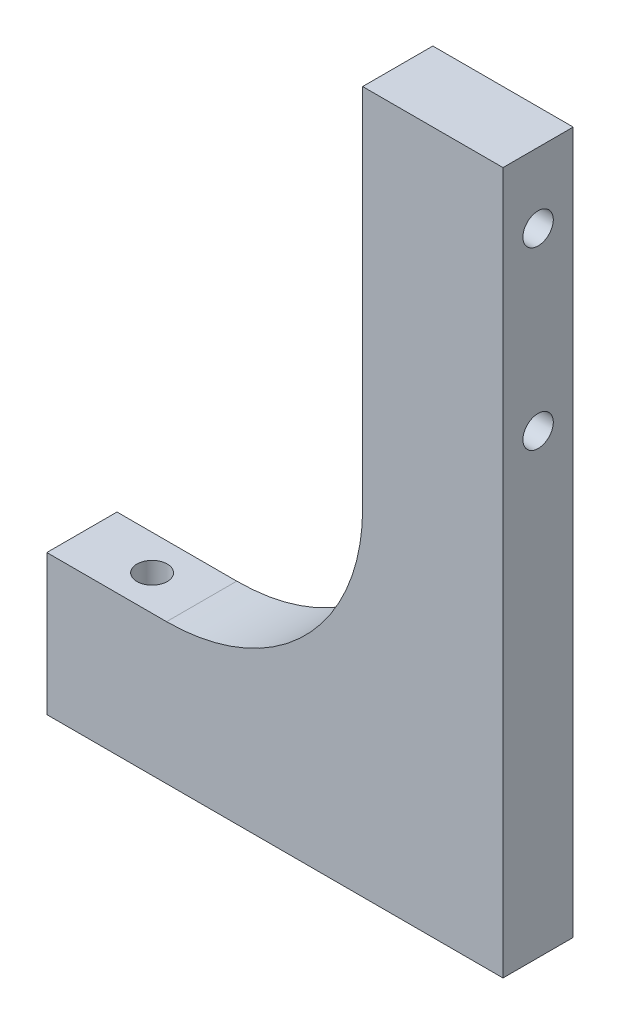
ISO-10303-21;
HEADER;
FILE_DESCRIPTION(('STEP AP214'),'2;1');
FILE_NAME('part.step','',(''),(''),'','','');
FILE_SCHEMA(('AUTOMOTIVE_DESIGN { 1 0 10303 214 1 1 1 1 }'));
ENDSEC;
DATA;
#1=APPLICATION_CONTEXT('core data for automotive mechanical design processes');
#2=APPLICATION_PROTOCOL_DEFINITION('international standard','automotive_design',2000,#1);
#3=PRODUCT_CONTEXT('',#1,'mechanical');
#4=PRODUCT('Part','Part','',(#3));
#5=PRODUCT_RELATED_PRODUCT_CATEGORY('part','',(#4));
#6=PRODUCT_DEFINITION_FORMATION('','',#4);
#7=PRODUCT_DEFINITION_CONTEXT('part definition',#1,'design');
#8=PRODUCT_DEFINITION('design','',#6,#7);
#9=PRODUCT_DEFINITION_SHAPE('','',#8);
#10=(LENGTH_UNIT() NAMED_UNIT(*) SI_UNIT(.MILLI.,.METRE.));
#11=(NAMED_UNIT(*) PLANE_ANGLE_UNIT() SI_UNIT($,.RADIAN.));
#12=(NAMED_UNIT(*) SI_UNIT($,.STERADIAN.) SOLID_ANGLE_UNIT());
#13=UNCERTAINTY_MEASURE_WITH_UNIT(LENGTH_MEASURE(1.E-05),#10,'distance_accuracy_value','');
#14=(GEOMETRIC_REPRESENTATION_CONTEXT(3) GLOBAL_UNCERTAINTY_ASSIGNED_CONTEXT((#13)) GLOBAL_UNIT_ASSIGNED_CONTEXT((#10,
#11,#12)) REPRESENTATION_CONTEXT('',''));
#15=CARTESIAN_POINT('',(0.,0.,0.));
#16=DIRECTION('',(0.,0.,1.));
#17=DIRECTION('',(1.,0.,0.));
#18=AXIS2_PLACEMENT_3D('',#15,#16,#17);
#19=CARTESIAN_POINT('',(-50.8,194.731808122781,25.4));
#20=DIRECTION('',(0.,-1.,0.));
#21=DIRECTION('',(0.,0.,-1.));
#22=AXIS2_PLACEMENT_3D('',#19,#20,#21);
#23=PLANE('',#22);
#24=DIRECTION('',(-1.,0.,0.));
#25=VECTOR('',#24,1.);
#26=CARTESIAN_POINT('',(-50.8,194.731808122781,0.));
#27=LINE('',#26,#25);
#28=CARTESIAN_POINT('',(0.,194.731808122781,0.));
#29=VERTEX_POINT('',#28);
#30=CARTESIAN_POINT('',(-50.8,194.731808122781,0.));
#31=VERTEX_POINT('',#30);
#32=EDGE_CURVE('E124',#29,#31,#27,.T.);
#33=ORIENTED_EDGE('',*,*,#32,.T.);
#34=DIRECTION('',(0.,0.,-1.));
#35=VECTOR('',#34,1.);
#36=CARTESIAN_POINT('',(-50.8,194.731808122781,25.4));
#37=LINE('',#36,#35);
#38=CARTESIAN_POINT('',(-50.8,194.731808122781,25.4));
#39=VERTEX_POINT('',#38);
#40=EDGE_CURVE('E105',#39,#31,#37,.T.);
#41=ORIENTED_EDGE('',*,*,#40,.F.);
#42=DIRECTION('',(-1.,0.,0.));
#43=VECTOR('',#42,1.);
#44=CARTESIAN_POINT('',(-50.8,194.731808122781,25.4));
#45=LINE('',#44,#43);
#46=CARTESIAN_POINT('',(0.,194.731808122781,25.4));
#47=VERTEX_POINT('',#46);
#48=EDGE_CURVE('E111',#47,#39,#45,.T.);
#49=ORIENTED_EDGE('',*,*,#48,.F.);
#50=DIRECTION('',(0.,0.,-1.));
#51=VECTOR('',#50,1.);
#52=CARTESIAN_POINT('',(0.,194.731808122781,25.4));
#53=LINE('',#52,#51);
#54=EDGE_CURVE('E161',#47,#29,#53,.T.);
#55=ORIENTED_EDGE('',*,*,#54,.T.);
#56=EDGE_LOOP('',(#33,#41,#49,#55));
#57=FACE_BOUND('',#56,.T.);
#58=ADVANCED_FACE('F45',(#57),#23,.F.);
#59=CARTESIAN_POINT('',(-50.8,-8.46819187721898,25.4));
#60=DIRECTION('',(1.,0.,0.));
#61=DIRECTION('',(0.,0.,-1.));
#62=AXIS2_PLACEMENT_3D('',#59,#60,#61);
#63=PLANE('',#62);
#64=CARTESIAN_POINT('',(-50.8,169.331808122781,12.7));
#65=DIRECTION('',(-1.,0.,0.));
#66=DIRECTION('',(0.,0.,1.));
#67=AXIS2_PLACEMENT_3D('',#64,#65,#66);
#68=CIRCLE('',#67,5.50000000000001);
#69=CARTESIAN_POINT('',(-50.8,169.331808122781,18.2));
#70=VERTEX_POINT('',#69);
#71=EDGE_CURVE('E246',#70,#70,#68,.T.);
#72=ORIENTED_EDGE('',*,*,#71,.F.);
#73=EDGE_LOOP('',(#72));
#74=FACE_BOUND('',#73,.T.);
#75=CARTESIAN_POINT('',(-50.8,105.831808122781,12.7));
#76=DIRECTION('',(-1.,0.,0.));
#77=DIRECTION('',(0.,0.,1.));
#78=AXIS2_PLACEMENT_3D('',#75,#76,#77);
#79=CIRCLE('',#78,5.49999999999999);
#80=CARTESIAN_POINT('',(-50.8,105.831808122781,18.2));
#81=VERTEX_POINT('',#80);
#82=EDGE_CURVE('E234',#81,#81,#79,.T.);
#83=ORIENTED_EDGE('',*,*,#82,.F.);
#84=EDGE_LOOP('',(#83));
#85=FACE_BOUND('',#84,.T.);
#86=DIRECTION('',(0.,-1.,0.));
#87=VECTOR('',#86,1.);
#88=CARTESIAN_POINT('',(-50.8,-8.46819187721898,0.));
#89=LINE('',#88,#87);
#90=CARTESIAN_POINT('',(-50.8,62.491808122781,0.));
#91=VERTEX_POINT('',#90);
#92=EDGE_CURVE('E207',#31,#91,#89,.T.);
#93=ORIENTED_EDGE('',*,*,#92,.T.);
#94=DIRECTION('',(0.,0.,-1.));
#95=VECTOR('',#94,1.);
#96=CARTESIAN_POINT('',(-50.8,62.491808122781,25.4));
#97=LINE('',#96,#95);
#98=CARTESIAN_POINT('',(-50.8,62.491808122781,25.4));
#99=VERTEX_POINT('',#98);
#100=EDGE_CURVE('E61',#91,#99,#97,.F.);
#101=ORIENTED_EDGE('',*,*,#100,.T.);
#102=DIRECTION('',(0.,-1.,0.));
#103=VECTOR('',#102,1.);
#104=CARTESIAN_POINT('',(-50.8,-8.46819187721898,25.4));
#105=LINE('',#104,#103);
#106=EDGE_CURVE('E101',#39,#99,#105,.T.);
#107=ORIENTED_EDGE('',*,*,#106,.F.);
#108=ORIENTED_EDGE('',*,*,#40,.T.);
#109=EDGE_LOOP('',(#93,#101,#107,#108));
#110=FACE_BOUND('',#109,.T.);
#111=ADVANCED_FACE('F103',(#74,#85,#110),#63,.F.);
#112=CARTESIAN_POINT('',(-165.1,-8.46819187721898,25.4));
#113=DIRECTION('',(0.,-1.,0.));
#114=DIRECTION('',(1.,0.,0.));
#115=AXIS2_PLACEMENT_3D('',#112,#113,#114);
#116=PLANE('',#115);
#117=CARTESIAN_POINT('',(-139.7,-8.46819187721897,12.7));
#118=DIRECTION('',(0.,1.,0.));
#119=DIRECTION('',(0.,0.,1.));
#120=AXIS2_PLACEMENT_3D('',#117,#118,#119);
#121=CIRCLE('',#120,5.50000000000001);
#122=CARTESIAN_POINT('',(-139.7,-8.46819187721897,18.2));
#123=VERTEX_POINT('',#122);
#124=EDGE_CURVE('E222',#123,#123,#121,.T.);
#125=ORIENTED_EDGE('',*,*,#124,.F.);
#126=EDGE_LOOP('',(#125));
#127=FACE_BOUND('',#126,.T.);
#128=DIRECTION('',(-1.,0.,0.));
#129=VECTOR('',#128,1.);
#130=CARTESIAN_POINT('',(-165.1,-8.46819187721898,25.4));
#131=LINE('',#130,#129);
#132=CARTESIAN_POINT('',(-121.76,-8.46819187721898,25.4));
#133=VERTEX_POINT('',#132);
#134=CARTESIAN_POINT('',(-165.1,-8.46819187721898,25.4));
#135=VERTEX_POINT('',#134);
#136=EDGE_CURVE('E110',#133,#135,#131,.T.);
#137=ORIENTED_EDGE('',*,*,#136,.F.);
#138=DIRECTION('',(0.,0.,-1.));
#139=VECTOR('',#138,1.);
#140=CARTESIAN_POINT('',(-121.76,-8.46819187721898,0.));
#141=LINE('',#140,#139);
#142=CARTESIAN_POINT('',(-121.76,-8.46819187721898,0.));
#143=VERTEX_POINT('',#142);
#144=EDGE_CURVE('E126',#133,#143,#141,.T.);
#145=ORIENTED_EDGE('',*,*,#144,.T.);
#146=DIRECTION('',(-1.,0.,0.));
#147=VECTOR('',#146,1.);
#148=CARTESIAN_POINT('',(-165.1,-8.46819187721898,0.));
#149=LINE('',#148,#147);
#150=CARTESIAN_POINT('',(-165.1,-8.46819187721898,0.));
#151=VERTEX_POINT('',#150);
#152=EDGE_CURVE('E202',#143,#151,#149,.T.);
#153=ORIENTED_EDGE('',*,*,#152,.T.);
#154=DIRECTION('',(0.,0.,-1.));
#155=VECTOR('',#154,1.);
#156=CARTESIAN_POINT('',(-165.1,-8.46819187721898,25.4));
#157=LINE('',#156,#155);
#158=EDGE_CURVE('E127',#135,#151,#157,.T.);
#159=ORIENTED_EDGE('',*,*,#158,.F.);
#160=EDGE_LOOP('',(#137,#145,#153,#159));
#161=FACE_BOUND('',#160,.T.);
#162=ADVANCED_FACE('F259',(#127,#161),#116,.F.);
#163=CARTESIAN_POINT('',(-165.1,-59.268191877219,25.4));
#164=DIRECTION('',(1.,0.,0.));
#165=DIRECTION('',(0.,1.,0.));
#166=AXIS2_PLACEMENT_3D('',#163,#164,#165);
#167=PLANE('',#166);
#168=DIRECTION('',(0.,-1.,0.));
#169=VECTOR('',#168,1.);
#170=CARTESIAN_POINT('',(-165.1,-59.268191877219,0.));
#171=LINE('',#170,#169);
#172=CARTESIAN_POINT('',(-165.1,-59.268191877219,0.));
#173=VERTEX_POINT('',#172);
#174=EDGE_CURVE('E197',#151,#173,#171,.T.);
#175=ORIENTED_EDGE('',*,*,#174,.T.);
#176=DIRECTION('',(0.,0.,-1.));
#177=VECTOR('',#176,1.);
#178=CARTESIAN_POINT('',(-165.1,-59.268191877219,25.4));
#179=LINE('',#178,#177);
#180=CARTESIAN_POINT('',(-165.1,-59.268191877219,25.4));
#181=VERTEX_POINT('',#180);
#182=EDGE_CURVE('E136',#181,#173,#179,.T.);
#183=ORIENTED_EDGE('',*,*,#182,.F.);
#184=DIRECTION('',(0.,-1.,0.));
#185=VECTOR('',#184,1.);
#186=CARTESIAN_POINT('',(-165.1,-59.268191877219,25.4));
#187=LINE('',#186,#185);
#188=EDGE_CURVE('E175',#135,#181,#187,.T.);
#189=ORIENTED_EDGE('',*,*,#188,.F.);
#190=ORIENTED_EDGE('',*,*,#158,.T.);
#191=EDGE_LOOP('',(#175,#183,#189,#190));
#192=FACE_BOUND('',#191,.T.);
#193=ADVANCED_FACE('F284',(#192),#167,.F.);
#194=CARTESIAN_POINT('',(0.,-59.268191877219,25.4));
#195=DIRECTION('',(0.,1.,0.));
#196=DIRECTION('',(-1.,0.,0.));
#197=AXIS2_PLACEMENT_3D('',#194,#195,#196);
#198=PLANE('',#197);
#199=CARTESIAN_POINT('',(-139.7,-59.268191877219,12.7));
#200=DIRECTION('',(0.,1.,0.));
#201=DIRECTION('',(0.,0.,1.));
#202=AXIS2_PLACEMENT_3D('',#199,#200,#201);
#203=CIRCLE('',#202,5.49999999999998);
#204=CARTESIAN_POINT('',(-139.7,-59.268191877219,18.2));
#205=VERTEX_POINT('',#204);
#206=EDGE_CURVE('E216',#205,#205,#203,.T.);
#207=ORIENTED_EDGE('',*,*,#206,.T.);
#208=EDGE_LOOP('',(#207));
#209=FACE_BOUND('',#208,.T.);
#210=DIRECTION('',(1.,0.,0.));
#211=VECTOR('',#210,1.);
#212=CARTESIAN_POINT('',(0.,-59.268191877219,0.));
#213=LINE('',#212,#211);
#214=CARTESIAN_POINT('',(0.,-59.268191877219,0.));
#215=VERTEX_POINT('',#214);
#216=EDGE_CURVE('E192',#173,#215,#213,.T.);
#217=ORIENTED_EDGE('',*,*,#216,.T.);
#218=DIRECTION('',(0.,0.,-1.));
#219=VECTOR('',#218,1.);
#220=CARTESIAN_POINT('',(0.,-59.268191877219,25.4));
#221=LINE('',#220,#219);
#222=CARTESIAN_POINT('',(0.,-59.268191877219,25.4));
#223=VERTEX_POINT('',#222);
#224=EDGE_CURVE('E156',#223,#215,#221,.T.);
#225=ORIENTED_EDGE('',*,*,#224,.F.);
#226=DIRECTION('',(1.,0.,0.));
#227=VECTOR('',#226,1.);
#228=CARTESIAN_POINT('',(0.,-59.268191877219,25.4));
#229=LINE('',#228,#227);
#230=EDGE_CURVE('E170',#181,#223,#229,.T.);
#231=ORIENTED_EDGE('',*,*,#230,.F.);
#232=ORIENTED_EDGE('',*,*,#182,.T.);
#233=EDGE_LOOP('',(#217,#225,#231,#232));
#234=FACE_BOUND('',#233,.T.);
#235=ADVANCED_FACE('F288',(#209,#234),#198,.F.);
#236=CARTESIAN_POINT('',(0.,194.731808122781,25.4));
#237=DIRECTION('',(-1.,0.,0.));
#238=DIRECTION('',(0.,-1.,0.));
#239=AXIS2_PLACEMENT_3D('',#236,#237,#238);
#240=PLANE('',#239);
#241=CARTESIAN_POINT('',(0.,169.331808122781,12.7));
#242=DIRECTION('',(-1.,0.,0.));
#243=DIRECTION('',(0.,0.,1.));
#244=AXIS2_PLACEMENT_3D('',#241,#242,#243);
#245=CIRCLE('',#244,5.49999999999998);
#246=CARTESIAN_POINT('',(0.,169.331808122781,18.2));
#247=VERTEX_POINT('',#246);
#248=EDGE_CURVE('E240',#247,#247,#245,.T.);
#249=ORIENTED_EDGE('',*,*,#248,.T.);
#250=EDGE_LOOP('',(#249));
#251=FACE_BOUND('',#250,.T.);
#252=CARTESIAN_POINT('',(0.,105.831808122781,12.7));
#253=DIRECTION('',(-1.,0.,0.));
#254=DIRECTION('',(0.,0.,1.));
#255=AXIS2_PLACEMENT_3D('',#252,#253,#254);
#256=CIRCLE('',#255,5.49999999999999);
#257=CARTESIAN_POINT('',(0.,105.831808122781,18.2));
#258=VERTEX_POINT('',#257);
#259=EDGE_CURVE('E228',#258,#258,#256,.T.);
#260=ORIENTED_EDGE('',*,*,#259,.T.);
#261=EDGE_LOOP('',(#260));
#262=FACE_BOUND('',#261,.T.);
#263=DIRECTION('',(0.,1.,0.));
#264=VECTOR('',#263,1.);
#265=CARTESIAN_POINT('',(0.,194.731808122781,0.));
#266=LINE('',#265,#264);
#267=EDGE_CURVE('E121',#215,#29,#266,.T.);
#268=ORIENTED_EDGE('',*,*,#267,.T.);
#269=ORIENTED_EDGE('',*,*,#54,.F.);
#270=DIRECTION('',(0.,1.,0.));
#271=VECTOR('',#270,1.);
#272=CARTESIAN_POINT('',(0.,194.731808122781,25.4));
#273=LINE('',#272,#271);
#274=EDGE_CURVE('E116',#223,#47,#273,.T.);
#275=ORIENTED_EDGE('',*,*,#274,.F.);
#276=ORIENTED_EDGE('',*,*,#224,.T.);
#277=EDGE_LOOP('',(#268,#269,#275,#276));
#278=FACE_BOUND('',#277,.T.);
#279=ADVANCED_FACE('F292',(#251,#262,#278),#240,.F.);
#280=CARTESIAN_POINT('',(0.,0.,25.4));
#281=DIRECTION('',(0.,0.,-1.));
#282=DIRECTION('',(-1.,0.,0.));
#283=AXIS2_PLACEMENT_3D('',#280,#281,#282);
#284=PLANE('',#283);
#285=ORIENTED_EDGE('',*,*,#48,.T.);
#286=ORIENTED_EDGE('',*,*,#106,.T.);
#287=CARTESIAN_POINT('',(-121.76,62.491808122781,25.4));
#288=DIRECTION('',(0.,0.,-1.));
#289=DIRECTION('',(-1.,0.,0.));
#290=AXIS2_PLACEMENT_3D('',#287,#288,#289);
#291=CIRCLE('',#290,70.96);
#292=EDGE_CURVE('E11',#99,#133,#291,.T.);
#293=ORIENTED_EDGE('',*,*,#292,.T.);
#294=ORIENTED_EDGE('',*,*,#136,.T.);
#295=ORIENTED_EDGE('',*,*,#188,.T.);
#296=ORIENTED_EDGE('',*,*,#230,.T.);
#297=ORIENTED_EDGE('',*,*,#274,.T.);
#298=EDGE_LOOP('',(#285,#286,#293,#294,#295,#296,#297));
#299=FACE_BOUND('',#298,.T.);
#300=ADVANCED_FACE('F114',(#299),#284,.F.);
#301=CARTESIAN_POINT('',(0.,0.,0.));
#302=DIRECTION('',(0.,0.,-1.));
#303=DIRECTION('',(-1.,0.,0.));
#304=AXIS2_PLACEMENT_3D('',#301,#302,#303);
#305=PLANE('',#304);
#306=ORIENTED_EDGE('',*,*,#32,.F.);
#307=ORIENTED_EDGE('',*,*,#267,.F.);
#308=ORIENTED_EDGE('',*,*,#216,.F.);
#309=ORIENTED_EDGE('',*,*,#174,.F.);
#310=ORIENTED_EDGE('',*,*,#152,.F.);
#311=CARTESIAN_POINT('',(-121.76,62.491808122781,0.));
#312=DIRECTION('',(0.,0.,-1.));
#313=DIRECTION('',(-1.,0.,0.));
#314=AXIS2_PLACEMENT_3D('',#311,#312,#313);
#315=CIRCLE('',#314,70.96);
#316=EDGE_CURVE('E54',#143,#91,#315,.F.);
#317=ORIENTED_EDGE('',*,*,#316,.T.);
#318=ORIENTED_EDGE('',*,*,#92,.F.);
#319=EDGE_LOOP('',(#306,#307,#308,#309,#310,#317,#318));
#320=FACE_BOUND('',#319,.T.);
#321=ADVANCED_FACE('F274',(#320),#305,.T.);
#322=CARTESIAN_POINT('',(-139.7,-8.46819187721897,12.7));
#323=DIRECTION('',(0.,1.,0.));
#324=DIRECTION('',(0.,0.,1.));
#325=AXIS2_PLACEMENT_3D('',#322,#323,#324);
#326=CYLINDRICAL_SURFACE('',#325,5.49999999999999);
#327=ORIENTED_EDGE('',*,*,#206,.F.);
#328=EDGE_LOOP('',(#327));
#329=FACE_BOUND('',#328,.T.);
#330=ORIENTED_EDGE('',*,*,#124,.T.);
#331=EDGE_LOOP('',(#330));
#332=FACE_BOUND('',#331,.T.);
#333=ADVANCED_FACE('F265',(#329,#332),#326,.F.);
#334=CARTESIAN_POINT('',(-50.8,105.831808122781,12.7));
#335=DIRECTION('',(-1.,0.,0.));
#336=DIRECTION('',(0.,0.,1.));
#337=AXIS2_PLACEMENT_3D('',#334,#335,#336);
#338=CYLINDRICAL_SURFACE('',#337,5.49999999999999);
#339=ORIENTED_EDGE('',*,*,#259,.F.);
#340=EDGE_LOOP('',(#339));
#341=FACE_BOUND('',#340,.T.);
#342=ORIENTED_EDGE('',*,*,#82,.T.);
#343=EDGE_LOOP('',(#342));
#344=FACE_BOUND('',#343,.T.);
#345=ADVANCED_FACE('F263',(#341,#344),#338,.F.);
#346=CARTESIAN_POINT('',(-50.8,169.331808122781,12.7));
#347=DIRECTION('',(-1.,0.,0.));
#348=DIRECTION('',(0.,0.,1.));
#349=AXIS2_PLACEMENT_3D('',#346,#347,#348);
#350=CYLINDRICAL_SURFACE('',#349,5.49999999999999);
#351=ORIENTED_EDGE('',*,*,#248,.F.);
#352=EDGE_LOOP('',(#351));
#353=FACE_BOUND('',#352,.T.);
#354=ORIENTED_EDGE('',*,*,#71,.T.);
#355=EDGE_LOOP('',(#354));
#356=FACE_BOUND('',#355,.T.);
#357=ADVANCED_FACE('F255',(#353,#356),#350,.F.);
#358=CARTESIAN_POINT('',(-121.76,62.491808122781,25.4));
#359=DIRECTION('',(0.,0.,1.));
#360=DIRECTION('',(1.,0.,0.));
#361=AXIS2_PLACEMENT_3D('',#358,#359,#360);
#362=CYLINDRICAL_SURFACE('',#361,70.96);
#363=ORIENTED_EDGE('',*,*,#292,.F.);
#364=ORIENTED_EDGE('',*,*,#100,.F.);
#365=ORIENTED_EDGE('',*,*,#316,.F.);
#366=ORIENTED_EDGE('',*,*,#144,.F.);
#367=EDGE_LOOP('',(#363,#364,#365,#366));
#368=FACE_BOUND('',#367,.T.);
#369=ADVANCED_FACE('F47',(#368),#362,.F.);
#370=CLOSED_SHELL('',(#58,#111,#162,#193,#235,#279,#300,#321,#333,#345,#357,#369));
#371=MANIFOLD_SOLID_BREP('B2',#370);
#372=ADVANCED_BREP_SHAPE_REPRESENTATION('',(#18,#371),#14);
#373=SHAPE_DEFINITION_REPRESENTATION(#9,#372);
ENDSEC;
END-ISO-10303-21;
